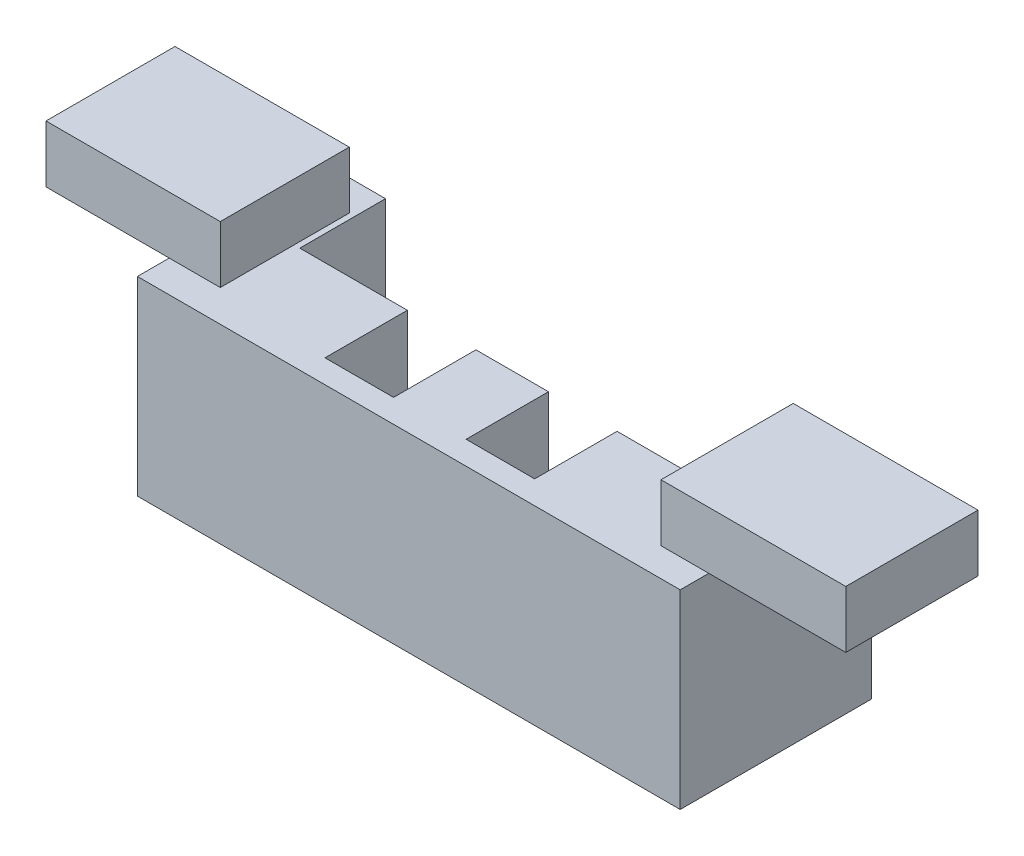
ISO-10303-21;
HEADER;
FILE_DESCRIPTION(('STEP AP214'),'2;1');
FILE_NAME('part.step','',(''),(''),'','','');
FILE_SCHEMA(('AUTOMOTIVE_DESIGN { 1 0 10303 214 1 1 1 1 }'));
ENDSEC;
DATA;
#1=APPLICATION_CONTEXT('core data for automotive mechanical design processes');
#2=APPLICATION_PROTOCOL_DEFINITION('international standard','automotive_design',2000,#1);
#3=PRODUCT_CONTEXT('',#1,'mechanical');
#4=PRODUCT('Part','Part','',(#3));
#5=PRODUCT_RELATED_PRODUCT_CATEGORY('part','',(#4));
#6=PRODUCT_DEFINITION_FORMATION('','',#4);
#7=PRODUCT_DEFINITION_CONTEXT('part definition',#1,'design');
#8=PRODUCT_DEFINITION('design','',#6,#7);
#9=PRODUCT_DEFINITION_SHAPE('','',#8);
#10=(LENGTH_UNIT() NAMED_UNIT(*) SI_UNIT(.MILLI.,.METRE.));
#11=(NAMED_UNIT(*) PLANE_ANGLE_UNIT() SI_UNIT($,.RADIAN.));
#12=(NAMED_UNIT(*) SI_UNIT($,.STERADIAN.) SOLID_ANGLE_UNIT());
#13=UNCERTAINTY_MEASURE_WITH_UNIT(LENGTH_MEASURE(1.E-05),#10,'distance_accuracy_value','');
#14=(GEOMETRIC_REPRESENTATION_CONTEXT(3) GLOBAL_UNCERTAINTY_ASSIGNED_CONTEXT((#13)) GLOBAL_UNIT_ASSIGNED_CONTEXT((#10,
#11,#12)) REPRESENTATION_CONTEXT('',''));
#15=CARTESIAN_POINT('',(0.,0.,0.));
#16=DIRECTION('',(0.,0.,1.));
#17=DIRECTION('',(1.,0.,0.));
#18=AXIS2_PLACEMENT_3D('',#15,#16,#17);
#19=CARTESIAN_POINT('',(0.,16.9164,0.));
#20=DIRECTION('',(0.,-1.,0.));
#21=DIRECTION('',(0.,0.,-1.));
#22=AXIS2_PLACEMENT_3D('',#19,#20,#21);
#23=PLANE('',#22);
#24=DIRECTION('',(1.,0.,0.));
#25=VECTOR('',#24,1.);
#26=CARTESIAN_POINT('',(44.0103145803146,16.9164,-2.54131063231069));
#27=LINE('',#26,#25);
#28=CARTESIAN_POINT('',(44.0103145803146,16.9164,-2.54131063231069));
#29=VERTEX_POINT('',#28);
#30=CARTESIAN_POINT('',(48.26,16.9164,-2.54131063231069));
#31=VERTEX_POINT('',#30);
#32=EDGE_CURVE('E57',#29,#31,#27,.T.);
#33=ORIENTED_EDGE('',*,*,#32,.F.);
#34=DIRECTION('',(0.,0.,1.));
#35=VECTOR('',#34,1.);
#36=CARTESIAN_POINT('',(44.0103145803146,16.9164,-14.2969396879397));
#37=LINE('',#36,#35);
#38=CARTESIAN_POINT('',(44.0103145803146,16.9164,-14.2969396879397));
#39=VERTEX_POINT('',#38);
#40=EDGE_CURVE('E62',#39,#29,#37,.T.);
#41=ORIENTED_EDGE('',*,*,#40,.F.);
#42=DIRECTION('',(-1.,0.,0.));
#43=VECTOR('',#42,1.);
#44=CARTESIAN_POINT('',(44.0103145803146,16.9164,-14.2969396879397));
#45=LINE('',#44,#43);
#46=CARTESIAN_POINT('',(48.26,16.9164,-14.2969396879397));
#47=VERTEX_POINT('',#46);
#48=EDGE_CURVE('E540',#47,#39,#45,.T.);
#49=ORIENTED_EDGE('',*,*,#48,.F.);
#50=DIRECTION('',(0.,0.,-1.));
#51=VECTOR('',#50,1.);
#52=CARTESIAN_POINT('',(48.26,16.9164,0.));
#53=LINE('',#52,#51);
#54=CARTESIAN_POINT('',(48.26,16.9164,-17.018));
#55=VERTEX_POINT('',#54);
#56=EDGE_CURVE('E389',#47,#55,#53,.T.);
#57=ORIENTED_EDGE('',*,*,#56,.T.);
#58=DIRECTION('',(-1.,0.,0.));
#59=VECTOR('',#58,1.);
#60=CARTESIAN_POINT('',(0.,16.9164,-17.018));
#61=LINE('',#60,#59);
#62=CARTESIAN_POINT('',(43.5441399201617,16.9164,-17.018));
#63=VERTEX_POINT('',#62);
#64=EDGE_CURVE('E395',#55,#63,#61,.T.);
#65=ORIENTED_EDGE('',*,*,#64,.T.);
#66=DIRECTION('',(0.,0.,-1.));
#67=VECTOR('',#66,1.);
#68=CARTESIAN_POINT('',(43.5441399201617,16.9164,-9.398));
#69=LINE('',#68,#67);
#70=CARTESIAN_POINT('',(43.5441399201617,16.9164,-9.398));
#71=VERTEX_POINT('',#70);
#72=EDGE_CURVE('E366',#71,#63,#69,.T.);
#73=ORIENTED_EDGE('',*,*,#72,.F.);
#74=DIRECTION('',(1.,0.,0.));
#75=VECTOR('',#74,1.);
#76=CARTESIAN_POINT('',(43.5441399201617,16.9164,-9.398));
#77=LINE('',#76,#75);
#78=CARTESIAN_POINT('',(33.2457946197946,16.9164,-9.398));
#79=VERTEX_POINT('',#78);
#80=EDGE_CURVE('E351',#79,#71,#77,.T.);
#81=ORIENTED_EDGE('',*,*,#80,.F.);
#82=DIRECTION('',(0.,0.,-1.));
#83=VECTOR('',#82,1.);
#84=CARTESIAN_POINT('',(33.2457946197946,16.9164,0.));
#85=LINE('',#84,#83);
#86=CARTESIAN_POINT('',(33.2457946197946,16.9164,-2.07396146496143));
#87=VERTEX_POINT('',#86);
#88=EDGE_CURVE('E309',#87,#79,#85,.T.);
#89=ORIENTED_EDGE('',*,*,#88,.F.);
#90=DIRECTION('',(1.,0.,0.));
#91=VECTOR('',#90,1.);
#92=CARTESIAN_POINT('',(0.,16.9164,-2.07396146496143));
#93=LINE('',#92,#91);
#94=CARTESIAN_POINT('',(27.1497946197946,16.9164,-2.07396146496143));
#95=VERTEX_POINT('',#94);
#96=EDGE_CURVE('E442',#95,#87,#93,.T.);
#97=ORIENTED_EDGE('',*,*,#96,.F.);
#98=DIRECTION('',(0.,0.,1.));
#99=VECTOR('',#98,1.);
#100=CARTESIAN_POINT('',(27.1497946197946,16.9164,0.));
#101=LINE('',#100,#99);
#102=CARTESIAN_POINT('',(27.1497946197946,16.9164,-9.398));
#103=VERTEX_POINT('',#102);
#104=EDGE_CURVE('E327',#103,#95,#101,.T.);
#105=ORIENTED_EDGE('',*,*,#104,.F.);
#106=CARTESIAN_POINT('',(20.699266973267,16.9164,-9.398));
#107=VERTEX_POINT('',#106);
#108=EDGE_CURVE('E357',#107,#103,#77,.T.);
#109=ORIENTED_EDGE('',*,*,#108,.F.);
#110=DIRECTION('',(0.,0.,-1.));
#111=VECTOR('',#110,1.);
#112=CARTESIAN_POINT('',(20.699266973267,16.9164,0.));
#113=LINE('',#112,#111);
#114=CARTESIAN_POINT('',(20.699266973267,16.9164,-2.07396146496143));
#115=VERTEX_POINT('',#114);
#116=EDGE_CURVE('E330',#115,#107,#113,.T.);
#117=ORIENTED_EDGE('',*,*,#116,.F.);
#118=DIRECTION('',(1.,0.,0.));
#119=VECTOR('',#118,1.);
#120=CARTESIAN_POINT('',(0.,16.9164,-2.07396146496143));
#121=LINE('',#120,#119);
#122=CARTESIAN_POINT('',(14.603266973267,16.9164,-2.07396146496143));
#123=VERTEX_POINT('',#122);
#124=EDGE_CURVE('E43',#123,#115,#121,.T.);
#125=ORIENTED_EDGE('',*,*,#124,.F.);
#126=DIRECTION('',(0.,0.,1.));
#127=VECTOR('',#126,1.);
#128=CARTESIAN_POINT('',(14.603266973267,16.9164,0.));
#129=LINE('',#128,#127);
#130=CARTESIAN_POINT('',(14.603266973267,16.9164,-9.398));
#131=VERTEX_POINT('',#130);
#132=EDGE_CURVE('E333',#131,#123,#129,.T.);
#133=ORIENTED_EDGE('',*,*,#132,.F.);
#134=CARTESIAN_POINT('',(5.04058401058402,16.9164,-9.398));
#135=VERTEX_POINT('',#134);
#136=EDGE_CURVE('E352',#135,#131,#77,.T.);
#137=ORIENTED_EDGE('',*,*,#136,.F.);
#138=DIRECTION('',(0.,0.,-1.));
#139=VECTOR('',#138,1.);
#140=CARTESIAN_POINT('',(5.04058401058402,16.9164,-9.398));
#141=LINE('',#140,#139);
#142=CARTESIAN_POINT('',(5.04058401058402,16.9164,-17.018));
#143=VERTEX_POINT('',#142);
#144=EDGE_CURVE('E370',#135,#143,#141,.T.);
#145=ORIENTED_EDGE('',*,*,#144,.T.);
#146=CARTESIAN_POINT('',(0.,16.9164,-17.018));
#147=VERTEX_POINT('',#146);
#148=EDGE_CURVE('E393',#143,#147,#61,.T.);
#149=ORIENTED_EDGE('',*,*,#148,.T.);
#150=DIRECTION('',(0.,0.,1.));
#151=VECTOR('',#150,1.);
#152=CARTESIAN_POINT('',(0.,16.9164,0.));
#153=LINE('',#152,#151);
#154=CARTESIAN_POINT('',(0.,16.9164,-14.2969396879397));
#155=VERTEX_POINT('',#154);
#156=EDGE_CURVE('E380',#147,#155,#153,.T.);
#157=ORIENTED_EDGE('',*,*,#156,.T.);
#158=DIRECTION('',(-1.,0.,0.));
#159=VECTOR('',#158,1.);
#160=CARTESIAN_POINT('',(-10.9571374871375,16.9164,-14.2969396879397));
#161=LINE('',#160,#159);
#162=CARTESIAN_POINT('',(4.5372849072849,16.9164,-14.2969396879397));
#163=VERTEX_POINT('',#162);
#164=EDGE_CURVE('E255',#163,#155,#161,.T.);
#165=ORIENTED_EDGE('',*,*,#164,.F.);
#166=DIRECTION('',(0.,0.,-1.));
#167=VECTOR('',#166,1.);
#168=CARTESIAN_POINT('',(4.5372849072849,16.9164,-14.2969396879397));
#169=LINE('',#168,#167);
#170=CARTESIAN_POINT('',(4.5372849072849,16.9164,-2.82891011991018));
#171=VERTEX_POINT('',#170);
#172=EDGE_CURVE('E267',#171,#163,#169,.T.);
#173=ORIENTED_EDGE('',*,*,#172,.F.);
#174=DIRECTION('',(1.,0.,0.));
#175=VECTOR('',#174,1.);
#176=CARTESIAN_POINT('',(-10.9571374871375,16.9164,-2.82891011991018));
#177=LINE('',#176,#175);
#178=CARTESIAN_POINT('',(0.,16.9164,-2.82891011991018));
#179=VERTEX_POINT('',#178);
#180=EDGE_CURVE('E11',#179,#171,#177,.T.);
#181=ORIENTED_EDGE('',*,*,#180,.F.);
#182=CARTESIAN_POINT('',(0.,16.9164,0.));
#183=VERTEX_POINT('',#182);
#184=EDGE_CURVE('E386',#179,#183,#153,.T.);
#185=ORIENTED_EDGE('',*,*,#184,.T.);
#186=DIRECTION('',(1.,0.,0.));
#187=VECTOR('',#186,1.);
#188=CARTESIAN_POINT('',(0.,16.9164,0.));
#189=LINE('',#188,#187);
#190=CARTESIAN_POINT('',(48.26,16.9164,0.));
#191=VERTEX_POINT('',#190);
#192=EDGE_CURVE('E384',#183,#191,#189,.T.);
#193=ORIENTED_EDGE('',*,*,#192,.T.);
#194=EDGE_CURVE('E390',#191,#31,#53,.T.);
#195=ORIENTED_EDGE('',*,*,#194,.T.);
#196=EDGE_LOOP('',(#33,#41,#49,#57,#65,#73,#81,#89,#97,#105,#109,#117,#125,#133,#137,#145,#149,
#157,#165,#173,#181,#185,#193,#195));
#197=FACE_BOUND('',#196,.T.);
#198=ADVANCED_FACE('F39',(#197),#23,.F.);
#199=CARTESIAN_POINT('',(0.,0.,-9.398));
#200=DIRECTION('',(0.,0.,-1.));
#201=DIRECTION('',(-1.,0.,0.));
#202=AXIS2_PLACEMENT_3D('',#199,#200,#201);
#203=PLANE('',#202);
#204=ORIENTED_EDGE('',*,*,#136,.T.);
#205=DIRECTION('',(0.,-1.,0.));
#206=VECTOR('',#205,1.);
#207=CARTESIAN_POINT('',(14.603266973267,0.,-9.398));
#208=LINE('',#207,#206);
#209=CARTESIAN_POINT('',(14.603266973267,1.68652414880447,-9.398));
#210=VERTEX_POINT('',#209);
#211=EDGE_CURVE('E439',#131,#210,#208,.T.);
#212=ORIENTED_EDGE('',*,*,#211,.T.);
#213=DIRECTION('',(-1.,0.,0.));
#214=VECTOR('',#213,1.);
#215=CARTESIAN_POINT('',(43.5441399201617,1.68652414880447,-9.398));
#216=LINE('',#215,#214);
#217=CARTESIAN_POINT('',(5.04058401058402,1.68652414880447,-9.398));
#218=VERTEX_POINT('',#217);
#219=EDGE_CURVE('E341',#210,#218,#216,.T.);
#220=ORIENTED_EDGE('',*,*,#219,.T.);
#221=DIRECTION('',(0.,1.,0.));
#222=VECTOR('',#221,1.);
#223=CARTESIAN_POINT('',(5.04058401058402,16.9164,-9.398));
#224=LINE('',#223,#222);
#225=EDGE_CURVE('E347',#218,#135,#224,.T.);
#226=ORIENTED_EDGE('',*,*,#225,.T.);
#227=EDGE_LOOP('',(#204,#212,#220,#226));
#228=FACE_BOUND('',#227,.T.);
#229=ADVANCED_FACE('F496',(#228),#203,.T.);
#230=CARTESIAN_POINT('',(27.1497946197946,1.68652414880447,-9.398));
#231=VERTEX_POINT('',#230);
#232=CARTESIAN_POINT('',(20.699266973267,1.68652414880447,-9.398));
#233=VERTEX_POINT('',#232);
#234=EDGE_CURVE('E348',#231,#233,#216,.T.);
#235=ORIENTED_EDGE('',*,*,#234,.T.);
#236=DIRECTION('',(0.,1.,0.));
#237=VECTOR('',#236,1.);
#238=CARTESIAN_POINT('',(20.699266973267,0.,-9.398));
#239=LINE('',#238,#237);
#240=EDGE_CURVE('E435',#233,#107,#239,.T.);
#241=ORIENTED_EDGE('',*,*,#240,.T.);
#242=ORIENTED_EDGE('',*,*,#108,.T.);
#243=DIRECTION('',(0.,-1.,0.));
#244=VECTOR('',#243,1.);
#245=CARTESIAN_POINT('',(27.1497946197946,0.,-9.398));
#246=LINE('',#245,#244);
#247=EDGE_CURVE('E431',#103,#231,#246,.T.);
#248=ORIENTED_EDGE('',*,*,#247,.T.);
#249=EDGE_LOOP('',(#235,#241,#242,#248));
#250=FACE_BOUND('',#249,.T.);
#251=ADVANCED_FACE('F501',(#250),#203,.T.);
#252=CARTESIAN_POINT('',(43.5441399201617,1.68652414880447,-9.398));
#253=VERTEX_POINT('',#252);
#254=CARTESIAN_POINT('',(33.2457946197946,1.68652414880447,-9.398));
#255=VERTEX_POINT('',#254);
#256=EDGE_CURVE('E343',#253,#255,#216,.T.);
#257=ORIENTED_EDGE('',*,*,#256,.T.);
#258=DIRECTION('',(0.,1.,0.));
#259=VECTOR('',#258,1.);
#260=CARTESIAN_POINT('',(33.2457946197946,0.,-9.398));
#261=LINE('',#260,#259);
#262=EDGE_CURVE('E427',#255,#79,#261,.T.);
#263=ORIENTED_EDGE('',*,*,#262,.T.);
#264=ORIENTED_EDGE('',*,*,#80,.T.);
#265=DIRECTION('',(0.,-1.,0.));
#266=VECTOR('',#265,1.);
#267=CARTESIAN_POINT('',(43.5441399201617,16.9164,-9.398));
#268=LINE('',#267,#266);
#269=EDGE_CURVE('E337',#71,#253,#268,.T.);
#270=ORIENTED_EDGE('',*,*,#269,.T.);
#271=EDGE_LOOP('',(#257,#263,#264,#270));
#272=FACE_BOUND('',#271,.T.);
#273=ADVANCED_FACE('F470',(#272),#203,.T.);
#274=CARTESIAN_POINT('',(0.,16.9164,0.));
#275=DIRECTION('',(1.,0.,0.));
#276=DIRECTION('',(0.,0.,-1.));
#277=AXIS2_PLACEMENT_3D('',#274,#275,#276);
#278=PLANE('',#277);
#279=DIRECTION('',(0.,0.,1.));
#280=VECTOR('',#279,1.);
#281=CARTESIAN_POINT('',(0.,0.,0.));
#282=LINE('',#281,#280);
#283=CARTESIAN_POINT('',(0.,0.,-17.018));
#284=VERTEX_POINT('',#283);
#285=CARTESIAN_POINT('',(0.,0.,0.));
#286=VERTEX_POINT('',#285);
#287=EDGE_CURVE('E369',#284,#286,#282,.T.);
#288=ORIENTED_EDGE('',*,*,#287,.T.);
#289=DIRECTION('',(0.,-1.,0.));
#290=VECTOR('',#289,1.);
#291=CARTESIAN_POINT('',(0.,16.9164,0.));
#292=LINE('',#291,#290);
#293=EDGE_CURVE('E423',#183,#286,#292,.T.);
#294=ORIENTED_EDGE('',*,*,#293,.F.);
#295=ORIENTED_EDGE('',*,*,#184,.F.);
#296=EDGE_CURVE('E385',#155,#179,#153,.T.);
#297=ORIENTED_EDGE('',*,*,#296,.F.);
#298=ORIENTED_EDGE('',*,*,#156,.F.);
#299=DIRECTION('',(0.,-1.,0.));
#300=VECTOR('',#299,1.);
#301=CARTESIAN_POINT('',(0.,16.9164,-17.018));
#302=LINE('',#301,#300);
#303=EDGE_CURVE('E399',#147,#284,#302,.T.);
#304=ORIENTED_EDGE('',*,*,#303,.T.);
#305=EDGE_LOOP('',(#288,#294,#295,#297,#298,#304));
#306=FACE_BOUND('',#305,.T.);
#307=ADVANCED_FACE('F41',(#306),#278,.F.);
#308=CARTESIAN_POINT('',(0.,16.9164,0.));
#309=DIRECTION('',(0.,0.,-1.));
#310=DIRECTION('',(-1.,0.,0.));
#311=AXIS2_PLACEMENT_3D('',#308,#309,#310);
#312=PLANE('',#311);
#313=DIRECTION('',(1.,0.,0.));
#314=VECTOR('',#313,1.);
#315=CARTESIAN_POINT('',(0.,0.,0.));
#316=LINE('',#315,#314);
#317=CARTESIAN_POINT('',(48.26,0.,0.));
#318=VERTEX_POINT('',#317);
#319=EDGE_CURVE('E403',#286,#318,#316,.T.);
#320=ORIENTED_EDGE('',*,*,#319,.T.);
#321=DIRECTION('',(0.,-1.,0.));
#322=VECTOR('',#321,1.);
#323=CARTESIAN_POINT('',(48.26,16.9164,0.));
#324=LINE('',#323,#322);
#325=EDGE_CURVE('E419',#191,#318,#324,.T.);
#326=ORIENTED_EDGE('',*,*,#325,.F.);
#327=ORIENTED_EDGE('',*,*,#192,.F.);
#328=ORIENTED_EDGE('',*,*,#293,.T.);
#329=EDGE_LOOP('',(#320,#326,#327,#328));
#330=FACE_BOUND('',#329,.T.);
#331=ADVANCED_FACE('F520',(#330),#312,.F.);
#332=CARTESIAN_POINT('',(48.26,16.9164,0.));
#333=DIRECTION('',(-1.,0.,0.));
#334=DIRECTION('',(0.,0.,1.));
#335=AXIS2_PLACEMENT_3D('',#332,#333,#334);
#336=PLANE('',#335);
#337=DIRECTION('',(0.,0.,-1.));
#338=VECTOR('',#337,1.);
#339=CARTESIAN_POINT('',(48.26,0.,0.));
#340=LINE('',#339,#338);
#341=CARTESIAN_POINT('',(48.26,0.,-17.018));
#342=VERTEX_POINT('',#341);
#343=EDGE_CURVE('E406',#318,#342,#340,.T.);
#344=ORIENTED_EDGE('',*,*,#343,.T.);
#345=DIRECTION('',(0.,-1.,0.));
#346=VECTOR('',#345,1.);
#347=CARTESIAN_POINT('',(48.26,16.9164,-17.018));
#348=LINE('',#347,#346);
#349=EDGE_CURVE('E415',#55,#342,#348,.T.);
#350=ORIENTED_EDGE('',*,*,#349,.F.);
#351=ORIENTED_EDGE('',*,*,#56,.F.);
#352=EDGE_CURVE('E394',#31,#47,#53,.T.);
#353=ORIENTED_EDGE('',*,*,#352,.F.);
#354=ORIENTED_EDGE('',*,*,#194,.F.);
#355=ORIENTED_EDGE('',*,*,#325,.T.);
#356=EDGE_LOOP('',(#344,#350,#351,#353,#354,#355));
#357=FACE_BOUND('',#356,.T.);
#358=ADVANCED_FACE('F527',(#357),#336,.F.);
#359=CARTESIAN_POINT('',(0.,16.9164,-17.018));
#360=DIRECTION('',(0.,0.,1.));
#361=DIRECTION('',(1.,0.,0.));
#362=AXIS2_PLACEMENT_3D('',#359,#360,#361);
#363=PLANE('',#362);
#364=DIRECTION('',(-1.,0.,0.));
#365=VECTOR('',#364,1.);
#366=CARTESIAN_POINT('',(43.5441399201617,1.68652414880447,-17.018));
#367=LINE('',#366,#365);
#368=CARTESIAN_POINT('',(43.5441399201617,1.68652414880447,-17.018));
#369=VERTEX_POINT('',#368);
#370=CARTESIAN_POINT('',(5.04058401058402,1.68652414880447,-17.018));
#371=VERTEX_POINT('',#370);
#372=EDGE_CURVE('E361',#369,#371,#367,.T.);
#373=ORIENTED_EDGE('',*,*,#372,.F.);
#374=DIRECTION('',(0.,-1.,0.));
#375=VECTOR('',#374,1.);
#376=CARTESIAN_POINT('',(43.5441399201617,16.9164,-17.018));
#377=LINE('',#376,#375);
#378=EDGE_CURVE('E336',#63,#369,#377,.T.);
#379=ORIENTED_EDGE('',*,*,#378,.F.);
#380=ORIENTED_EDGE('',*,*,#64,.F.);
#381=ORIENTED_EDGE('',*,*,#349,.T.);
#382=DIRECTION('',(-1.,0.,0.));
#383=VECTOR('',#382,1.);
#384=CARTESIAN_POINT('',(0.,0.,-17.018));
#385=LINE('',#384,#383);
#386=EDGE_CURVE('E409',#342,#284,#385,.T.);
#387=ORIENTED_EDGE('',*,*,#386,.T.);
#388=ORIENTED_EDGE('',*,*,#303,.F.);
#389=ORIENTED_EDGE('',*,*,#148,.F.);
#390=DIRECTION('',(0.,1.,0.));
#391=VECTOR('',#390,1.);
#392=CARTESIAN_POINT('',(5.04058401058402,16.9164,-17.018));
#393=LINE('',#392,#391);
#394=EDGE_CURVE('E342',#371,#143,#393,.T.);
#395=ORIENTED_EDGE('',*,*,#394,.F.);
#396=EDGE_LOOP('',(#373,#379,#380,#381,#387,#388,#389,#395));
#397=FACE_BOUND('',#396,.T.);
#398=ADVANCED_FACE('F482',(#397),#363,.F.);
#399=CARTESIAN_POINT('',(0.,0.,0.));
#400=DIRECTION('',(0.,-1.,0.));
#401=DIRECTION('',(0.,0.,-1.));
#402=AXIS2_PLACEMENT_3D('',#399,#400,#401);
#403=PLANE('',#402);
#404=ORIENTED_EDGE('',*,*,#287,.F.);
#405=ORIENTED_EDGE('',*,*,#386,.F.);
#406=ORIENTED_EDGE('',*,*,#343,.F.);
#407=ORIENTED_EDGE('',*,*,#319,.F.);
#408=EDGE_LOOP('',(#404,#405,#406,#407));
#409=FACE_BOUND('',#408,.T.);
#410=ADVANCED_FACE('F524',(#409),#403,.T.);
#411=CARTESIAN_POINT('',(43.5441399201617,16.9164,-9.398));
#412=DIRECTION('',(1.,0.,0.));
#413=DIRECTION('',(0.,0.,-1.));
#414=AXIS2_PLACEMENT_3D('',#411,#412,#413);
#415=PLANE('',#414);
#416=ORIENTED_EDGE('',*,*,#378,.T.);
#417=DIRECTION('',(0.,0.,-1.));
#418=VECTOR('',#417,1.);
#419=CARTESIAN_POINT('',(43.5441399201617,1.68652414880447,-9.398));
#420=LINE('',#419,#418);
#421=EDGE_CURVE('E356',#253,#369,#420,.T.);
#422=ORIENTED_EDGE('',*,*,#421,.F.);
#423=ORIENTED_EDGE('',*,*,#269,.F.);
#424=ORIENTED_EDGE('',*,*,#72,.T.);
#425=EDGE_LOOP('',(#416,#422,#423,#424));
#426=FACE_BOUND('',#425,.T.);
#427=ADVANCED_FACE('F475',(#426),#415,.F.);
#428=CARTESIAN_POINT('',(5.04058401058402,16.9164,-9.398));
#429=DIRECTION('',(-1.,0.,0.));
#430=DIRECTION('',(0.,0.,1.));
#431=AXIS2_PLACEMENT_3D('',#428,#429,#430);
#432=PLANE('',#431);
#433=ORIENTED_EDGE('',*,*,#394,.T.);
#434=ORIENTED_EDGE('',*,*,#144,.F.);
#435=ORIENTED_EDGE('',*,*,#225,.F.);
#436=DIRECTION('',(0.,0.,-1.));
#437=VECTOR('',#436,1.);
#438=CARTESIAN_POINT('',(5.04058401058402,1.68652414880447,-9.398));
#439=LINE('',#438,#437);
#440=EDGE_CURVE('E374',#218,#371,#439,.T.);
#441=ORIENTED_EDGE('',*,*,#440,.T.);
#442=EDGE_LOOP('',(#433,#434,#435,#441));
#443=FACE_BOUND('',#442,.T.);
#444=ADVANCED_FACE('F492',(#443),#432,.F.);
#445=CARTESIAN_POINT('',(43.5441399201617,1.68652414880447,-9.398));
#446=DIRECTION('',(0.,-1.,0.));
#447=DIRECTION('',(0.,0.,-1.));
#448=AXIS2_PLACEMENT_3D('',#445,#446,#447);
#449=PLANE('',#448);
#450=ORIENTED_EDGE('',*,*,#372,.T.);
#451=ORIENTED_EDGE('',*,*,#440,.F.);
#452=ORIENTED_EDGE('',*,*,#219,.F.);
#453=DIRECTION('',(0.,0.,1.));
#454=VECTOR('',#453,1.);
#455=CARTESIAN_POINT('',(14.603266973267,1.68652414880447,-17.018));
#456=LINE('',#455,#454);
#457=CARTESIAN_POINT('',(14.603266973267,1.68652414880447,-2.07396146496143));
#458=VERTEX_POINT('',#457);
#459=EDGE_CURVE('E291',#210,#458,#456,.T.);
#460=ORIENTED_EDGE('',*,*,#459,.T.);
#461=DIRECTION('',(1.,0.,0.));
#462=VECTOR('',#461,1.);
#463=CARTESIAN_POINT('',(14.603266973267,1.68652414880447,-2.07396146496143));
#464=LINE('',#463,#462);
#465=CARTESIAN_POINT('',(20.699266973267,1.68652414880447,-2.07396146496143));
#466=VERTEX_POINT('',#465);
#467=EDGE_CURVE('E295',#458,#466,#464,.T.);
#468=ORIENTED_EDGE('',*,*,#467,.T.);
#469=DIRECTION('',(0.,0.,-1.));
#470=VECTOR('',#469,1.);
#471=CARTESIAN_POINT('',(20.699266973267,1.68652414880447,-17.018));
#472=LINE('',#471,#470);
#473=EDGE_CURVE('E300',#466,#233,#472,.T.);
#474=ORIENTED_EDGE('',*,*,#473,.T.);
#475=ORIENTED_EDGE('',*,*,#234,.F.);
#476=DIRECTION('',(0.,0.,1.));
#477=VECTOR('',#476,1.);
#478=CARTESIAN_POINT('',(27.1497946197946,1.68652414880447,-2.07396146496143));
#479=LINE('',#478,#477);
#480=CARTESIAN_POINT('',(27.1497946197946,1.68652414880447,-2.07396146496143));
#481=VERTEX_POINT('',#480);
#482=EDGE_CURVE('E290',#231,#481,#479,.T.);
#483=ORIENTED_EDGE('',*,*,#482,.T.);
#484=DIRECTION('',(1.,0.,0.));
#485=VECTOR('',#484,1.);
#486=CARTESIAN_POINT('',(27.1497946197946,1.68652414880447,-2.07396146496143));
#487=LINE('',#486,#485);
#488=CARTESIAN_POINT('',(33.2457946197946,1.68652414880447,-2.07396146496143));
#489=VERTEX_POINT('',#488);
#490=EDGE_CURVE('E313',#481,#489,#487,.T.);
#491=ORIENTED_EDGE('',*,*,#490,.T.);
#492=DIRECTION('',(0.,0.,-1.));
#493=VECTOR('',#492,1.);
#494=CARTESIAN_POINT('',(33.2457946197946,1.68652414880447,-2.07396146496143));
#495=LINE('',#494,#493);
#496=EDGE_CURVE('E317',#489,#255,#495,.T.);
#497=ORIENTED_EDGE('',*,*,#496,.T.);
#498=ORIENTED_EDGE('',*,*,#256,.F.);
#499=ORIENTED_EDGE('',*,*,#421,.T.);
#500=EDGE_LOOP('',(#450,#451,#452,#460,#468,#474,#475,#483,#491,#497,#498,#499));
#501=FACE_BOUND('',#500,.T.);
#502=ADVANCED_FACE('F488',(#501),#449,.F.);
#503=CARTESIAN_POINT('',(27.1497946197946,16.9265241488045,-2.07396146496143));
#504=DIRECTION('',(0.,0.,-1.));
#505=DIRECTION('',(-1.,0.,0.));
#506=AXIS2_PLACEMENT_3D('',#503,#504,#505);
#507=PLANE('',#506);
#508=ORIENTED_EDGE('',*,*,#96,.T.);
#509=DIRECTION('',(0.,-1.,0.));
#510=VECTOR('',#509,1.);
#511=CARTESIAN_POINT('',(33.2457946197946,16.9265241488045,-2.07396146496143));
#512=LINE('',#511,#510);
#513=EDGE_CURVE('E320',#87,#489,#512,.T.);
#514=ORIENTED_EDGE('',*,*,#513,.T.);
#515=ORIENTED_EDGE('',*,*,#490,.F.);
#516=DIRECTION('',(0.,-1.,0.));
#517=VECTOR('',#516,1.);
#518=CARTESIAN_POINT('',(27.1497946197946,16.9265241488045,-2.07396146496143));
#519=LINE('',#518,#517);
#520=EDGE_CURVE('E296',#95,#481,#519,.T.);
#521=ORIENTED_EDGE('',*,*,#520,.F.);
#522=EDGE_LOOP('',(#508,#514,#515,#521));
#523=FACE_BOUND('',#522,.T.);
#524=ADVANCED_FACE('F598',(#523),#507,.T.);
#525=CARTESIAN_POINT('',(27.1497946197946,16.9265241488045,-2.07396146496143));
#526=DIRECTION('',(1.,0.,0.));
#527=DIRECTION('',(0.,0.,-1.));
#528=AXIS2_PLACEMENT_3D('',#525,#526,#527);
#529=PLANE('',#528);
#530=ORIENTED_EDGE('',*,*,#104,.T.);
#531=ORIENTED_EDGE('',*,*,#520,.T.);
#532=ORIENTED_EDGE('',*,*,#482,.F.);
#533=ORIENTED_EDGE('',*,*,#247,.F.);
#534=EDGE_LOOP('',(#530,#531,#532,#533));
#535=FACE_BOUND('',#534,.T.);
#536=ADVANCED_FACE('F594',(#535),#529,.T.);
#537=CARTESIAN_POINT('',(33.2457946197946,16.9265241488045,-2.07396146496143));
#538=DIRECTION('',(-1.,0.,0.));
#539=DIRECTION('',(0.,0.,1.));
#540=AXIS2_PLACEMENT_3D('',#537,#538,#539);
#541=PLANE('',#540);
#542=ORIENTED_EDGE('',*,*,#88,.T.);
#543=ORIENTED_EDGE('',*,*,#262,.F.);
#544=ORIENTED_EDGE('',*,*,#496,.F.);
#545=ORIENTED_EDGE('',*,*,#513,.F.);
#546=EDGE_LOOP('',(#542,#543,#544,#545));
#547=FACE_BOUND('',#546,.T.);
#548=ADVANCED_FACE('F605',(#547),#541,.T.);
#549=CARTESIAN_POINT('',(14.603266973267,16.9265241488045,-2.07396146496143));
#550=DIRECTION('',(0.,0.,-1.));
#551=DIRECTION('',(-1.,0.,0.));
#552=AXIS2_PLACEMENT_3D('',#549,#550,#551);
#553=PLANE('',#552);
#554=ORIENTED_EDGE('',*,*,#124,.T.);
#555=DIRECTION('',(0.,-1.,0.));
#556=VECTOR('',#555,1.);
#557=CARTESIAN_POINT('',(20.699266973267,16.9265241488045,-2.07396146496143));
#558=LINE('',#557,#556);
#559=EDGE_CURVE('E303',#115,#466,#558,.T.);
#560=ORIENTED_EDGE('',*,*,#559,.T.);
#561=ORIENTED_EDGE('',*,*,#467,.F.);
#562=DIRECTION('',(0.,-1.,0.));
#563=VECTOR('',#562,1.);
#564=CARTESIAN_POINT('',(14.603266973267,16.9265241488045,-2.07396146496143));
#565=LINE('',#564,#563);
#566=EDGE_CURVE('E306',#123,#458,#565,.T.);
#567=ORIENTED_EDGE('',*,*,#566,.F.);
#568=EDGE_LOOP('',(#554,#560,#561,#567));
#569=FACE_BOUND('',#568,.T.);
#570=ADVANCED_FACE('F453',(#569),#553,.T.);
#571=CARTESIAN_POINT('',(14.603266973267,16.9265241488045,-17.018));
#572=DIRECTION('',(1.,0.,0.));
#573=DIRECTION('',(0.,0.,-1.));
#574=AXIS2_PLACEMENT_3D('',#571,#572,#573);
#575=PLANE('',#574);
#576=ORIENTED_EDGE('',*,*,#132,.T.);
#577=ORIENTED_EDGE('',*,*,#566,.T.);
#578=ORIENTED_EDGE('',*,*,#459,.F.);
#579=ORIENTED_EDGE('',*,*,#211,.F.);
#580=EDGE_LOOP('',(#576,#577,#578,#579));
#581=FACE_BOUND('',#580,.T.);
#582=ADVANCED_FACE('F504',(#581),#575,.T.);
#583=CARTESIAN_POINT('',(20.699266973267,16.9265241488045,-17.018));
#584=DIRECTION('',(-1.,0.,0.));
#585=DIRECTION('',(0.,0.,1.));
#586=AXIS2_PLACEMENT_3D('',#583,#584,#585);
#587=PLANE('',#586);
#588=ORIENTED_EDGE('',*,*,#116,.T.);
#589=ORIENTED_EDGE('',*,*,#240,.F.);
#590=ORIENTED_EDGE('',*,*,#473,.F.);
#591=ORIENTED_EDGE('',*,*,#559,.F.);
#592=EDGE_LOOP('',(#588,#589,#590,#591));
#593=FACE_BOUND('',#592,.T.);
#594=ADVANCED_FACE('F459',(#593),#587,.T.);
#595=CARTESIAN_POINT('',(0.,16.9164,0.));
#596=DIRECTION('',(0.,1.,0.));
#597=DIRECTION('',(0.,0.,1.));
#598=AXIS2_PLACEMENT_3D('',#595,#596,#597);
#599=PLANE('',#598);
#600=CARTESIAN_POINT('',(-10.9571374871375,16.9164,-14.2969396879397));
#601=VERTEX_POINT('',#600);
#602=EDGE_CURVE('E271',#155,#601,#161,.T.);
#603=ORIENTED_EDGE('',*,*,#602,.F.);
#604=ORIENTED_EDGE('',*,*,#296,.T.);
#605=CARTESIAN_POINT('',(-10.9571374871375,16.9164,-2.82891011991018));
#606=VERTEX_POINT('',#605);
#607=EDGE_CURVE('E50',#606,#179,#177,.T.);
#608=ORIENTED_EDGE('',*,*,#607,.F.);
#609=DIRECTION('',(0.,0.,1.));
#610=VECTOR('',#609,1.);
#611=CARTESIAN_POINT('',(-10.9571374871375,16.9164,-14.2969396879397));
#612=LINE('',#611,#610);
#613=EDGE_CURVE('E240',#601,#606,#612,.T.);
#614=ORIENTED_EDGE('',*,*,#613,.F.);
#615=EDGE_LOOP('',(#603,#604,#608,#614));
#616=FACE_BOUND('',#615,.T.);
#617=ADVANCED_FACE('F617',(#616),#599,.F.);
#618=CARTESIAN_POINT('',(-10.9571374871375,21.9964,-14.2969396879397));
#619=DIRECTION('',(1.,0.,0.));
#620=DIRECTION('',(0.,0.,-1.));
#621=AXIS2_PLACEMENT_3D('',#618,#619,#620);
#622=PLANE('',#621);
#623=ORIENTED_EDGE('',*,*,#613,.T.);
#624=DIRECTION('',(0.,-1.,0.));
#625=VECTOR('',#624,1.);
#626=CARTESIAN_POINT('',(-10.9571374871375,21.9964,-2.82891011991018));
#627=LINE('',#626,#625);
#628=CARTESIAN_POINT('',(-10.9571374871375,21.9964,-2.82891011991018));
#629=VERTEX_POINT('',#628);
#630=EDGE_CURVE('E286',#629,#606,#627,.T.);
#631=ORIENTED_EDGE('',*,*,#630,.F.);
#632=DIRECTION('',(0.,0.,1.));
#633=VECTOR('',#632,1.);
#634=CARTESIAN_POINT('',(-10.9571374871375,21.9964,-14.2969396879397));
#635=LINE('',#634,#633);
#636=CARTESIAN_POINT('',(-10.9571374871375,21.9964,-14.2969396879397));
#637=VERTEX_POINT('',#636);
#638=EDGE_CURVE('E250',#637,#629,#635,.T.);
#639=ORIENTED_EDGE('',*,*,#638,.F.);
#640=DIRECTION('',(0.,-1.,0.));
#641=VECTOR('',#640,1.);
#642=CARTESIAN_POINT('',(-10.9571374871375,21.9964,-14.2969396879397));
#643=LINE('',#642,#641);
#644=EDGE_CURVE('E263',#637,#601,#643,.T.);
#645=ORIENTED_EDGE('',*,*,#644,.T.);
#646=EDGE_LOOP('',(#623,#631,#639,#645));
#647=FACE_BOUND('',#646,.T.);
#648=ADVANCED_FACE('F618',(#647),#622,.F.);
#649=CARTESIAN_POINT('',(-10.9571374871375,21.9964,-2.82891011991018));
#650=DIRECTION('',(0.,0.,-1.));
#651=DIRECTION('',(-1.,0.,0.));
#652=AXIS2_PLACEMENT_3D('',#649,#650,#651);
#653=PLANE('',#652);
#654=ORIENTED_EDGE('',*,*,#607,.T.);
#655=ORIENTED_EDGE('',*,*,#180,.T.);
#656=DIRECTION('',(0.,-1.,0.));
#657=VECTOR('',#656,1.);
#658=CARTESIAN_POINT('',(4.5372849072849,21.9964,-2.82891011991018));
#659=LINE('',#658,#657);
#660=CARTESIAN_POINT('',(4.5372849072849,21.9964,-2.82891011991018));
#661=VERTEX_POINT('',#660);
#662=EDGE_CURVE('E282',#661,#171,#659,.T.);
#663=ORIENTED_EDGE('',*,*,#662,.F.);
#664=DIRECTION('',(1.,0.,0.));
#665=VECTOR('',#664,1.);
#666=CARTESIAN_POINT('',(-10.9571374871375,21.9964,-2.82891011991018));
#667=LINE('',#666,#665);
#668=EDGE_CURVE('E254',#629,#661,#667,.T.);
#669=ORIENTED_EDGE('',*,*,#668,.F.);
#670=ORIENTED_EDGE('',*,*,#630,.T.);
#671=EDGE_LOOP('',(#654,#655,#663,#669,#670));
#672=FACE_BOUND('',#671,.T.);
#673=ADVANCED_FACE('F621',(#672),#653,.F.);
#674=CARTESIAN_POINT('',(4.5372849072849,21.9964,-14.2969396879397));
#675=DIRECTION('',(-1.,0.,0.));
#676=DIRECTION('',(0.,0.,1.));
#677=AXIS2_PLACEMENT_3D('',#674,#675,#676);
#678=PLANE('',#677);
#679=ORIENTED_EDGE('',*,*,#172,.T.);
#680=DIRECTION('',(0.,-1.,0.));
#681=VECTOR('',#680,1.);
#682=CARTESIAN_POINT('',(4.5372849072849,21.9964,-14.2969396879397));
#683=LINE('',#682,#681);
#684=CARTESIAN_POINT('',(4.5372849072849,21.9964,-14.2969396879397));
#685=VERTEX_POINT('',#684);
#686=EDGE_CURVE('E278',#685,#163,#683,.T.);
#687=ORIENTED_EDGE('',*,*,#686,.F.);
#688=DIRECTION('',(0.,0.,-1.));
#689=VECTOR('',#688,1.);
#690=CARTESIAN_POINT('',(4.5372849072849,21.9964,-14.2969396879397));
#691=LINE('',#690,#689);
#692=EDGE_CURVE('E258',#661,#685,#691,.T.);
#693=ORIENTED_EDGE('',*,*,#692,.F.);
#694=ORIENTED_EDGE('',*,*,#662,.T.);
#695=EDGE_LOOP('',(#679,#687,#693,#694));
#696=FACE_BOUND('',#695,.T.);
#697=ADVANCED_FACE('F625',(#696),#678,.F.);
#698=CARTESIAN_POINT('',(-10.9571374871375,21.9964,-14.2969396879397));
#699=DIRECTION('',(0.,0.,1.));
#700=DIRECTION('',(1.,0.,0.));
#701=AXIS2_PLACEMENT_3D('',#698,#699,#700);
#702=PLANE('',#701);
#703=ORIENTED_EDGE('',*,*,#164,.T.);
#704=ORIENTED_EDGE('',*,*,#602,.T.);
#705=ORIENTED_EDGE('',*,*,#644,.F.);
#706=DIRECTION('',(-1.,0.,0.));
#707=VECTOR('',#706,1.);
#708=CARTESIAN_POINT('',(-10.9571374871375,21.9964,-14.2969396879397));
#709=LINE('',#708,#707);
#710=EDGE_CURVE('E261',#685,#637,#709,.T.);
#711=ORIENTED_EDGE('',*,*,#710,.F.);
#712=ORIENTED_EDGE('',*,*,#686,.T.);
#713=EDGE_LOOP('',(#703,#704,#705,#711,#712));
#714=FACE_BOUND('',#713,.T.);
#715=ADVANCED_FACE('F629',(#714),#702,.F.);
#716=CARTESIAN_POINT('',(0.,21.9964,0.));
#717=DIRECTION('',(0.,1.,0.));
#718=DIRECTION('',(0.,0.,1.));
#719=AXIS2_PLACEMENT_3D('',#716,#717,#718);
#720=PLANE('',#719);
#721=ORIENTED_EDGE('',*,*,#638,.T.);
#722=ORIENTED_EDGE('',*,*,#668,.T.);
#723=ORIENTED_EDGE('',*,*,#692,.T.);
#724=ORIENTED_EDGE('',*,*,#710,.T.);
#725=EDGE_LOOP('',(#721,#722,#723,#724));
#726=FACE_BOUND('',#725,.T.);
#727=ADVANCED_FACE('F633',(#726),#720,.T.);
#728=CARTESIAN_POINT('',(0.,16.9164,0.));
#729=DIRECTION('',(0.,1.,0.));
#730=DIRECTION('',(0.,0.,1.));
#731=AXIS2_PLACEMENT_3D('',#728,#729,#730);
#732=PLANE('',#731);
#733=CARTESIAN_POINT('',(60.4394353094353,16.9164,-2.54131063231069));
#734=VERTEX_POINT('',#733);
#735=EDGE_CURVE('E531',#31,#734,#27,.T.);
#736=ORIENTED_EDGE('',*,*,#735,.F.);
#737=ORIENTED_EDGE('',*,*,#352,.T.);
#738=CARTESIAN_POINT('',(60.4394353094353,16.9164,-14.2969396879397));
#739=VERTEX_POINT('',#738);
#740=EDGE_CURVE('E236',#739,#47,#45,.T.);
#741=ORIENTED_EDGE('',*,*,#740,.F.);
#742=DIRECTION('',(0.,0.,-1.));
#743=VECTOR('',#742,1.);
#744=CARTESIAN_POINT('',(60.4394353094353,16.9164,-14.2969396879397));
#745=LINE('',#744,#743);
#746=EDGE_CURVE('E535',#734,#739,#745,.T.);
#747=ORIENTED_EDGE('',*,*,#746,.F.);
#748=EDGE_LOOP('',(#736,#737,#741,#747));
#749=FACE_BOUND('',#748,.T.);
#750=ADVANCED_FACE('F532',(#749),#732,.F.);
#751=CARTESIAN_POINT('',(44.0103145803146,21.9964,-14.2969396879397));
#752=DIRECTION('',(1.,0.,0.));
#753=DIRECTION('',(0.,0.,-1.));
#754=AXIS2_PLACEMENT_3D('',#751,#752,#753);
#755=PLANE('',#754);
#756=ORIENTED_EDGE('',*,*,#40,.T.);
#757=DIRECTION('',(0.,-1.,0.));
#758=VECTOR('',#757,1.);
#759=CARTESIAN_POINT('',(44.0103145803146,21.9964,-2.54131063231069));
#760=LINE('',#759,#758);
#761=CARTESIAN_POINT('',(44.0103145803146,21.9964,-2.54131063231069));
#762=VERTEX_POINT('',#761);
#763=EDGE_CURVE('E219',#762,#29,#760,.T.);
#764=ORIENTED_EDGE('',*,*,#763,.F.);
#765=DIRECTION('',(0.,0.,1.));
#766=VECTOR('',#765,1.);
#767=CARTESIAN_POINT('',(44.0103145803146,21.9964,-14.2969396879397));
#768=LINE('',#767,#766);
#769=CARTESIAN_POINT('',(44.0103145803146,21.9964,-14.2969396879397));
#770=VERTEX_POINT('',#769);
#771=EDGE_CURVE('E226',#770,#762,#768,.T.);
#772=ORIENTED_EDGE('',*,*,#771,.F.);
#773=DIRECTION('',(0.,-1.,0.));
#774=VECTOR('',#773,1.);
#775=CARTESIAN_POINT('',(44.0103145803146,21.9964,-14.2969396879397));
#776=LINE('',#775,#774);
#777=EDGE_CURVE('E547',#770,#39,#776,.T.);
#778=ORIENTED_EDGE('',*,*,#777,.T.);
#779=EDGE_LOOP('',(#756,#764,#772,#778));
#780=FACE_BOUND('',#779,.T.);
#781=ADVANCED_FACE('F238',(#780),#755,.F.);
#782=CARTESIAN_POINT('',(44.0103145803146,21.9964,-2.54131063231069));
#783=DIRECTION('',(0.,0.,-1.));
#784=DIRECTION('',(-1.,0.,0.));
#785=AXIS2_PLACEMENT_3D('',#782,#783,#784);
#786=PLANE('',#785);
#787=ORIENTED_EDGE('',*,*,#32,.T.);
#788=ORIENTED_EDGE('',*,*,#735,.T.);
#789=DIRECTION('',(0.,-1.,0.));
#790=VECTOR('',#789,1.);
#791=CARTESIAN_POINT('',(60.4394353094353,21.9964,-2.54131063231069));
#792=LINE('',#791,#790);
#793=CARTESIAN_POINT('',(60.4394353094353,21.9964,-2.54131063231069));
#794=VERTEX_POINT('',#793);
#795=EDGE_CURVE('E221',#794,#734,#792,.T.);
#796=ORIENTED_EDGE('',*,*,#795,.F.);
#797=DIRECTION('',(1.,0.,0.));
#798=VECTOR('',#797,1.);
#799=CARTESIAN_POINT('',(44.0103145803146,21.9964,-2.54131063231069));
#800=LINE('',#799,#798);
#801=EDGE_CURVE('E215',#762,#794,#800,.T.);
#802=ORIENTED_EDGE('',*,*,#801,.F.);
#803=ORIENTED_EDGE('',*,*,#763,.T.);
#804=EDGE_LOOP('',(#787,#788,#796,#802,#803));
#805=FACE_BOUND('',#804,.T.);
#806=ADVANCED_FACE('F217',(#805),#786,.F.);
#807=CARTESIAN_POINT('',(60.4394353094353,21.9964,-14.2969396879397));
#808=DIRECTION('',(-1.,0.,0.));
#809=DIRECTION('',(0.,0.,1.));
#810=AXIS2_PLACEMENT_3D('',#807,#808,#809);
#811=PLANE('',#810);
#812=ORIENTED_EDGE('',*,*,#746,.T.);
#813=DIRECTION('',(0.,-1.,0.));
#814=VECTOR('',#813,1.);
#815=CARTESIAN_POINT('',(60.4394353094353,21.9964,-14.2969396879397));
#816=LINE('',#815,#814);
#817=CARTESIAN_POINT('',(60.4394353094353,21.9964,-14.2969396879397));
#818=VERTEX_POINT('',#817);
#819=EDGE_CURVE('E246',#818,#739,#816,.T.);
#820=ORIENTED_EDGE('',*,*,#819,.F.);
#821=DIRECTION('',(0.,0.,-1.));
#822=VECTOR('',#821,1.);
#823=CARTESIAN_POINT('',(60.4394353094353,21.9964,-14.2969396879397));
#824=LINE('',#823,#822);
#825=EDGE_CURVE('E225',#794,#818,#824,.T.);
#826=ORIENTED_EDGE('',*,*,#825,.F.);
#827=ORIENTED_EDGE('',*,*,#795,.T.);
#828=EDGE_LOOP('',(#812,#820,#826,#827));
#829=FACE_BOUND('',#828,.T.);
#830=ADVANCED_FACE('F555',(#829),#811,.F.);
#831=CARTESIAN_POINT('',(44.0103145803146,21.9964,-14.2969396879397));
#832=DIRECTION('',(0.,0.,1.));
#833=DIRECTION('',(1.,0.,0.));
#834=AXIS2_PLACEMENT_3D('',#831,#832,#833);
#835=PLANE('',#834);
#836=ORIENTED_EDGE('',*,*,#740,.T.);
#837=ORIENTED_EDGE('',*,*,#48,.T.);
#838=ORIENTED_EDGE('',*,*,#777,.F.);
#839=DIRECTION('',(-1.,0.,0.));
#840=VECTOR('',#839,1.);
#841=CARTESIAN_POINT('',(44.0103145803146,21.9964,-14.2969396879397));
#842=LINE('',#841,#840);
#843=EDGE_CURVE('E231',#818,#770,#842,.T.);
#844=ORIENTED_EDGE('',*,*,#843,.F.);
#845=ORIENTED_EDGE('',*,*,#819,.T.);
#846=EDGE_LOOP('',(#836,#837,#838,#844,#845));
#847=FACE_BOUND('',#846,.T.);
#848=ADVANCED_FACE('F553',(#847),#835,.F.);
#849=CARTESIAN_POINT('',(0.,21.9964,0.));
#850=DIRECTION('',(0.,1.,0.));
#851=DIRECTION('',(0.,0.,1.));
#852=AXIS2_PLACEMENT_3D('',#849,#850,#851);
#853=PLANE('',#852);
#854=ORIENTED_EDGE('',*,*,#771,.T.);
#855=ORIENTED_EDGE('',*,*,#801,.T.);
#856=ORIENTED_EDGE('',*,*,#825,.T.);
#857=ORIENTED_EDGE('',*,*,#843,.T.);
#858=EDGE_LOOP('',(#854,#855,#856,#857));
#859=FACE_BOUND('',#858,.T.);
#860=ADVANCED_FACE('F229',(#859),#853,.T.);
#861=CLOSED_SHELL('',(#198,#229,#251,#273,#307,#331,#358,#398,#410,#427,#444,#502,#524,#536,
#548,#570,#582,#594,#617,#648,#673,#697,#715,#727,#750,#781,#806,#830,#848,#860));
#862=MANIFOLD_SOLID_BREP('B2',#861);
#863=ADVANCED_BREP_SHAPE_REPRESENTATION('',(#18,#862),#14);
#864=SHAPE_DEFINITION_REPRESENTATION(#9,#863);
ENDSEC;
END-ISO-10303-21;
